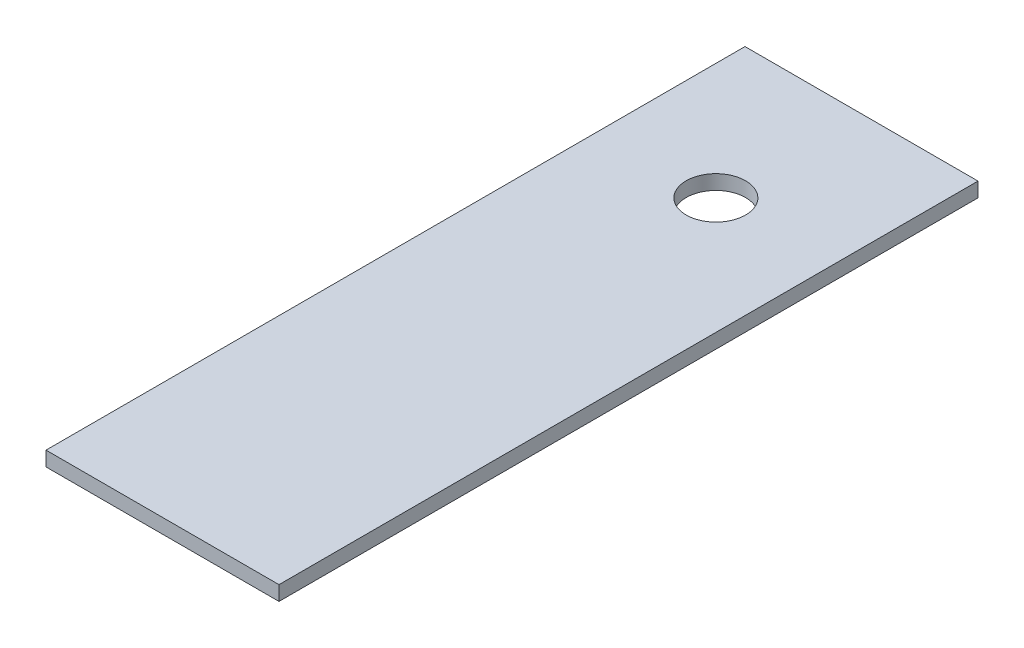
ISO-10303-21;
HEADER;
FILE_DESCRIPTION(('STEP AP214'),'2;1');
FILE_NAME('part.step','',(''),(''),'','','');
FILE_SCHEMA(('AUTOMOTIVE_DESIGN { 1 0 10303 214 1 1 1 1 }'));
ENDSEC;
DATA;
#1=APPLICATION_CONTEXT('core data for automotive mechanical design processes');
#2=APPLICATION_PROTOCOL_DEFINITION('international standard','automotive_design',2000,#1);
#3=PRODUCT_CONTEXT('',#1,'mechanical');
#4=PRODUCT('Part','Part','',(#3));
#5=PRODUCT_RELATED_PRODUCT_CATEGORY('part','',(#4));
#6=PRODUCT_DEFINITION_FORMATION('','',#4);
#7=PRODUCT_DEFINITION_CONTEXT('part definition',#1,'design');
#8=PRODUCT_DEFINITION('design','',#6,#7);
#9=PRODUCT_DEFINITION_SHAPE('','',#8);
#10=(LENGTH_UNIT() NAMED_UNIT(*) SI_UNIT(.MILLI.,.METRE.));
#11=(NAMED_UNIT(*) PLANE_ANGLE_UNIT() SI_UNIT($,.RADIAN.));
#12=(NAMED_UNIT(*) SI_UNIT($,.STERADIAN.) SOLID_ANGLE_UNIT());
#13=UNCERTAINTY_MEASURE_WITH_UNIT(LENGTH_MEASURE(1.E-05),#10,'distance_accuracy_value','');
#14=(GEOMETRIC_REPRESENTATION_CONTEXT(3) GLOBAL_UNCERTAINTY_ASSIGNED_CONTEXT((#13)) GLOBAL_UNIT_ASSIGNED_CONTEXT((#10,
#11,#12)) REPRESENTATION_CONTEXT('',''));
#15=CARTESIAN_POINT('',(0.,0.,0.));
#16=DIRECTION('',(0.,0.,1.));
#17=DIRECTION('',(1.,0.,0.));
#18=AXIS2_PLACEMENT_3D('',#15,#16,#17);
#19=CARTESIAN_POINT('',(1379.5375,-6.35,-279.222458600998));
#20=DIRECTION('',(1.,0.,0.));
#21=DIRECTION('',(0.,0.,-1.));
#22=AXIS2_PLACEMENT_3D('',#19,#20,#21);
#23=PLANE('',#22);
#24=DIRECTION('',(0.,0.,-1.));
#25=VECTOR('',#24,1.);
#26=CARTESIAN_POINT('',(1379.5375,0.,-279.222458600998));
#27=LINE('',#26,#25);
#28=CARTESIAN_POINT('',(1379.5375,0.,0.));
#29=VERTEX_POINT('',#28);
#30=CARTESIAN_POINT('',(1379.5375,0.,-304.8));
#31=VERTEX_POINT('',#30);
#32=EDGE_CURVE('E108',#29,#31,#27,.T.);
#33=ORIENTED_EDGE('',*,*,#32,.F.);
#34=DIRECTION('',(0.,1.,0.));
#35=VECTOR('',#34,1.);
#36=CARTESIAN_POINT('',(1379.5375,-6.35,0.));
#37=LINE('',#36,#35);
#38=CARTESIAN_POINT('',(1379.5375,-6.35,0.));
#39=VERTEX_POINT('',#38);
#40=EDGE_CURVE('E11',#39,#29,#37,.T.);
#41=ORIENTED_EDGE('',*,*,#40,.F.);
#42=DIRECTION('',(0.,0.,-1.));
#43=VECTOR('',#42,1.);
#44=CARTESIAN_POINT('',(1379.5375,-6.35,-279.222458600998));
#45=LINE('',#44,#43);
#46=CARTESIAN_POINT('',(1379.5375,-6.35,-304.8));
#47=VERTEX_POINT('',#46);
#48=EDGE_CURVE('E78',#39,#47,#45,.T.);
#49=ORIENTED_EDGE('',*,*,#48,.T.);
#50=DIRECTION('',(0.,1.,0.));
#51=VECTOR('',#50,1.);
#52=CARTESIAN_POINT('',(1379.5375,-6.35,-304.8));
#53=LINE('',#52,#51);
#54=EDGE_CURVE('E84',#47,#31,#53,.T.);
#55=ORIENTED_EDGE('',*,*,#54,.T.);
#56=EDGE_LOOP('',(#33,#41,#49,#55));
#57=FACE_BOUND('',#56,.T.);
#58=ADVANCED_FACE('F16',(#57),#23,.T.);
#59=CARTESIAN_POINT('',(2657.475,-6.35,0.));
#60=DIRECTION('',(0.,0.,-1.));
#61=DIRECTION('',(-1.,0.,0.));
#62=AXIS2_PLACEMENT_3D('',#59,#60,#61);
#63=PLANE('',#62);
#64=DIRECTION('',(-1.,0.,0.));
#65=VECTOR('',#64,1.);
#66=CARTESIAN_POINT('',(2657.475,0.,0.));
#67=LINE('',#66,#65);
#68=CARTESIAN_POINT('',(1277.9375,0.,0.));
#69=VERTEX_POINT('',#68);
#70=EDGE_CURVE('E62',#29,#69,#67,.T.);
#71=ORIENTED_EDGE('',*,*,#70,.T.);
#72=DIRECTION('',(0.,1.,0.));
#73=VECTOR('',#72,1.);
#74=CARTESIAN_POINT('',(1277.9375,-6.35,0.));
#75=LINE('',#74,#73);
#76=CARTESIAN_POINT('',(1277.9375,-6.35,0.));
#77=VERTEX_POINT('',#76);
#78=EDGE_CURVE('E26',#77,#69,#75,.T.);
#79=ORIENTED_EDGE('',*,*,#78,.F.);
#80=DIRECTION('',(-1.,0.,0.));
#81=VECTOR('',#80,1.);
#82=CARTESIAN_POINT('',(2657.475,-6.35,0.));
#83=LINE('',#82,#81);
#84=EDGE_CURVE('E40',#39,#77,#83,.T.);
#85=ORIENTED_EDGE('',*,*,#84,.F.);
#86=ORIENTED_EDGE('',*,*,#40,.T.);
#87=EDGE_LOOP('',(#71,#79,#85,#86));
#88=FACE_BOUND('',#87,.T.);
#89=ADVANCED_FACE('F123',(#88),#63,.F.);
#90=CARTESIAN_POINT('',(1277.9375,-6.35,-279.222458600998));
#91=DIRECTION('',(1.,0.,0.));
#92=DIRECTION('',(0.,0.,-1.));
#93=AXIS2_PLACEMENT_3D('',#90,#91,#92);
#94=PLANE('',#93);
#95=DIRECTION('',(0.,0.,-1.));
#96=VECTOR('',#95,1.);
#97=CARTESIAN_POINT('',(1277.9375,0.,-279.222458600998));
#98=LINE('',#97,#96);
#99=CARTESIAN_POINT('',(1277.9375,0.,-304.8));
#100=VERTEX_POINT('',#99);
#101=EDGE_CURVE('E110',#69,#100,#98,.T.);
#102=ORIENTED_EDGE('',*,*,#101,.T.);
#103=DIRECTION('',(0.,1.,0.));
#104=VECTOR('',#103,1.);
#105=CARTESIAN_POINT('',(1277.9375,-6.35,-304.8));
#106=LINE('',#105,#104);
#107=CARTESIAN_POINT('',(1277.9375,-6.35,-304.8));
#108=VERTEX_POINT('',#107);
#109=EDGE_CURVE('E92',#108,#100,#106,.T.);
#110=ORIENTED_EDGE('',*,*,#109,.F.);
#111=DIRECTION('',(0.,0.,-1.));
#112=VECTOR('',#111,1.);
#113=CARTESIAN_POINT('',(1277.9375,-6.35,-279.222458600998));
#114=LINE('',#113,#112);
#115=EDGE_CURVE('E69',#77,#108,#114,.T.);
#116=ORIENTED_EDGE('',*,*,#115,.F.);
#117=ORIENTED_EDGE('',*,*,#78,.T.);
#118=EDGE_LOOP('',(#102,#110,#116,#117));
#119=FACE_BOUND('',#118,.T.);
#120=ADVANCED_FACE('F122',(#119),#94,.F.);
#121=CARTESIAN_POINT('',(1482.8161728859,-6.35,-304.8));
#122=DIRECTION('',(0.,0.,1.));
#123=DIRECTION('',(1.,0.,0.));
#124=AXIS2_PLACEMENT_3D('',#121,#122,#123);
#125=PLANE('',#124);
#126=DIRECTION('',(1.,0.,0.));
#127=VECTOR('',#126,1.);
#128=CARTESIAN_POINT('',(1482.8161728859,0.,-304.8));
#129=LINE('',#128,#127);
#130=EDGE_CURVE('E87',#100,#31,#129,.T.);
#131=ORIENTED_EDGE('',*,*,#130,.T.);
#132=ORIENTED_EDGE('',*,*,#54,.F.);
#133=DIRECTION('',(1.,0.,0.));
#134=VECTOR('',#133,1.);
#135=CARTESIAN_POINT('',(1482.8161728859,-6.35,-304.8));
#136=LINE('',#135,#134);
#137=EDGE_CURVE('E74',#108,#47,#136,.T.);
#138=ORIENTED_EDGE('',*,*,#137,.F.);
#139=ORIENTED_EDGE('',*,*,#109,.T.);
#140=EDGE_LOOP('',(#131,#132,#138,#139));
#141=FACE_BOUND('',#140,.T.);
#142=ADVANCED_FACE('F85',(#141),#125,.F.);
#143=CARTESIAN_POINT('',(1328.7375,-6.35,-152.4));
#144=DIRECTION('',(0.,-1.,0.));
#145=DIRECTION('',(1.,0.,0.));
#146=AXIS2_PLACEMENT_3D('',#143,#144,#145);
#147=PLANE('',#146);
#148=CARTESIAN_POINT('',(1328.7375,-6.35,-241.3));
#149=DIRECTION('',(0.,-1.,0.));
#150=DIRECTION('',(0.,0.,-1.));
#151=AXIS2_PLACEMENT_3D('',#148,#149,#150);
#152=CIRCLE('',#151,12.954);
#153=CARTESIAN_POINT('',(1328.7375,-6.35,-254.254));
#154=VERTEX_POINT('',#153);
#155=EDGE_CURVE('E104',#154,#154,#152,.T.);
#156=ORIENTED_EDGE('',*,*,#155,.F.);
#157=EDGE_LOOP('',(#156));
#158=FACE_BOUND('',#157,.T.);
#159=ORIENTED_EDGE('',*,*,#48,.F.);
#160=ORIENTED_EDGE('',*,*,#84,.T.);
#161=ORIENTED_EDGE('',*,*,#115,.T.);
#162=ORIENTED_EDGE('',*,*,#137,.T.);
#163=EDGE_LOOP('',(#159,#160,#161,#162));
#164=FACE_BOUND('',#163,.T.);
#165=ADVANCED_FACE('F76',(#158,#164),#147,.T.);
#166=CARTESIAN_POINT('',(1328.7375,0.,-152.4));
#167=DIRECTION('',(0.,-1.,0.));
#168=DIRECTION('',(1.,0.,0.));
#169=AXIS2_PLACEMENT_3D('',#166,#167,#168);
#170=PLANE('',#169);
#171=CARTESIAN_POINT('',(1328.7375,0.,-241.3));
#172=DIRECTION('',(0.,-1.,0.));
#173=DIRECTION('',(0.,0.,-1.));
#174=AXIS2_PLACEMENT_3D('',#171,#172,#173);
#175=CIRCLE('',#174,12.954);
#176=CARTESIAN_POINT('',(1328.7375,0.,-254.254));
#177=VERTEX_POINT('',#176);
#178=EDGE_CURVE('E19',#177,#177,#175,.F.);
#179=ORIENTED_EDGE('',*,*,#178,.F.);
#180=EDGE_LOOP('',(#179));
#181=FACE_BOUND('',#180,.T.);
#182=ORIENTED_EDGE('',*,*,#32,.T.);
#183=ORIENTED_EDGE('',*,*,#130,.F.);
#184=ORIENTED_EDGE('',*,*,#101,.F.);
#185=ORIENTED_EDGE('',*,*,#70,.F.);
#186=EDGE_LOOP('',(#182,#183,#184,#185));
#187=FACE_BOUND('',#186,.T.);
#188=ADVANCED_FACE('F121',(#181,#187),#170,.F.);
#189=CARTESIAN_POINT('',(1328.7375,318.891929822994,-241.3));
#190=DIRECTION('',(0.,-1.,0.));
#191=DIRECTION('',(0.,0.,-1.));
#192=AXIS2_PLACEMENT_3D('',#189,#190,#191);
#193=CYLINDRICAL_SURFACE('',#192,12.954);
#194=ORIENTED_EDGE('',*,*,#155,.T.);
#195=EDGE_LOOP('',(#194));
#196=FACE_BOUND('',#195,.T.);
#197=ORIENTED_EDGE('',*,*,#178,.T.);
#198=EDGE_LOOP('',(#197));
#199=FACE_BOUND('',#198,.T.);
#200=ADVANCED_FACE('F142',(#196,#199),#193,.F.);
#201=CLOSED_SHELL('',(#58,#89,#120,#142,#165,#188,#200));
#202=MANIFOLD_SOLID_BREP('B1',#201);
#203=ADVANCED_BREP_SHAPE_REPRESENTATION('',(#18,#202),#14);
#204=SHAPE_DEFINITION_REPRESENTATION(#9,#203);
ENDSEC;
END-ISO-10303-21;
